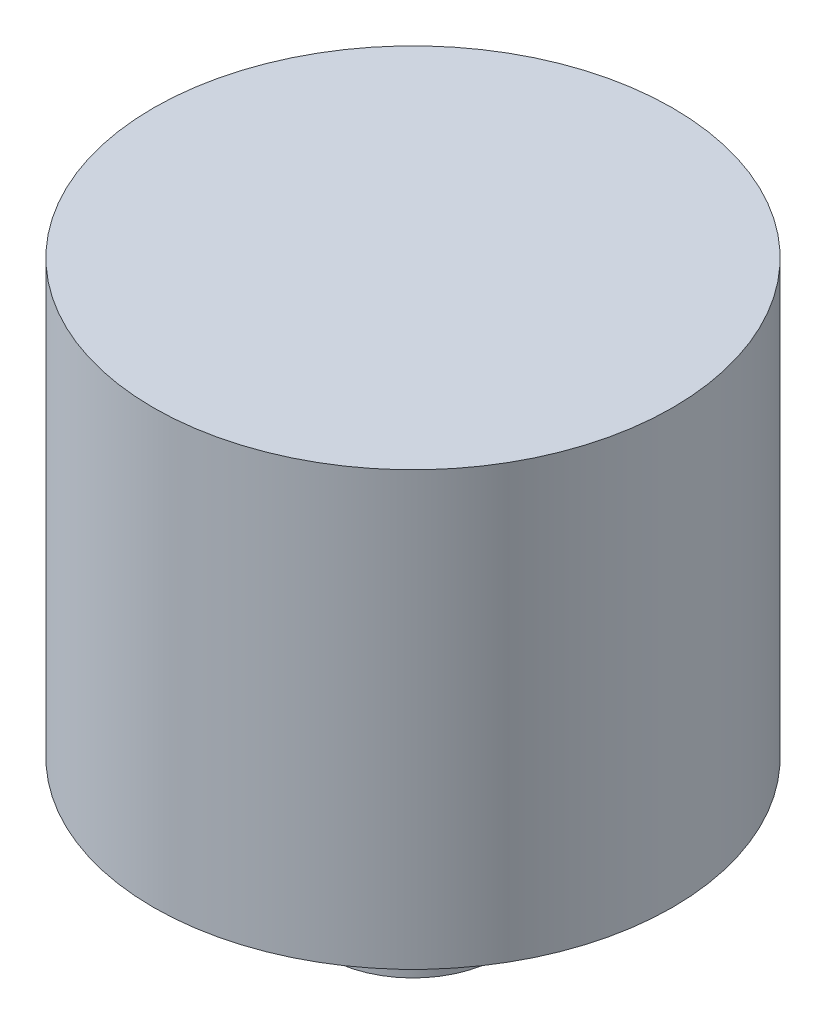
ISO-10303-21;
HEADER;
FILE_DESCRIPTION(('STEP AP214'),'2;1');
FILE_NAME('part.step','',(''),(''),'','','');
FILE_SCHEMA(('AUTOMOTIVE_DESIGN { 1 0 10303 214 1 1 1 1 }'));
ENDSEC;
DATA;
#1=APPLICATION_CONTEXT('core data for automotive mechanical design processes');
#2=APPLICATION_PROTOCOL_DEFINITION('international standard','automotive_design',2000,#1);
#3=PRODUCT_CONTEXT('',#1,'mechanical');
#4=PRODUCT('Part','Part','',(#3));
#5=PRODUCT_RELATED_PRODUCT_CATEGORY('part','',(#4));
#6=PRODUCT_DEFINITION_FORMATION('','',#4);
#7=PRODUCT_DEFINITION_CONTEXT('part definition',#1,'design');
#8=PRODUCT_DEFINITION('design','',#6,#7);
#9=PRODUCT_DEFINITION_SHAPE('','',#8);
#10=(LENGTH_UNIT() NAMED_UNIT(*) SI_UNIT(.MILLI.,.METRE.));
#11=(NAMED_UNIT(*) PLANE_ANGLE_UNIT() SI_UNIT($,.RADIAN.));
#12=(NAMED_UNIT(*) SI_UNIT($,.STERADIAN.) SOLID_ANGLE_UNIT());
#13=UNCERTAINTY_MEASURE_WITH_UNIT(LENGTH_MEASURE(1.E-05),#10,'distance_accuracy_value','');
#14=(GEOMETRIC_REPRESENTATION_CONTEXT(3) GLOBAL_UNCERTAINTY_ASSIGNED_CONTEXT((#13)) GLOBAL_UNIT_ASSIGNED_CONTEXT((#10,
#11,#12)) REPRESENTATION_CONTEXT('',''));
#15=CARTESIAN_POINT('',(0.,0.,0.));
#16=DIRECTION('',(0.,0.,1.));
#17=DIRECTION('',(1.,0.,0.));
#18=AXIS2_PLACEMENT_3D('',#15,#16,#17);
#19=CARTESIAN_POINT('',(0.,0.,0.));
#20=DIRECTION('',(0.,-1.,0.));
#21=DIRECTION('',(1.,0.,0.));
#22=AXIS2_PLACEMENT_3D('',#19,#20,#21);
#23=PLANE('',#22);
#24=CARTESIAN_POINT('',(0.,0.,0.));
#25=DIRECTION('',(0.,1.,0.));
#26=DIRECTION('',(-1.,0.,0.));
#27=AXIS2_PLACEMENT_3D('',#24,#25,#26);
#28=CIRCLE('',#27,2.);
#29=CARTESIAN_POINT('',(-2.,0.,0.));
#30=VERTEX_POINT('',#29);
#31=EDGE_CURVE('E10',#30,#30,#28,.T.);
#32=ORIENTED_EDGE('',*,*,#31,.F.);
#33=EDGE_LOOP('',(#32));
#34=FACE_BOUND('',#33,.T.);
#35=ADVANCED_FACE('F37',(#34),#23,.T.);
#36=CARTESIAN_POINT('',(0.,13.,0.));
#37=DIRECTION('',(0.,1.,0.));
#38=DIRECTION('',(-1.,0.,0.));
#39=AXIS2_PLACEMENT_3D('',#36,#37,#38);
#40=CYLINDRICAL_SURFACE('',#39,2.);
#41=ORIENTED_EDGE('',*,*,#31,.T.);
#42=EDGE_LOOP('',(#41));
#43=FACE_BOUND('',#42,.T.);
#44=CARTESIAN_POINT('',(0.,3.,0.));
#45=DIRECTION('',(0.,1.,0.));
#46=DIRECTION('',(-1.,0.,0.));
#47=AXIS2_PLACEMENT_3D('',#44,#45,#46);
#48=CIRCLE('',#47,2.);
#49=CARTESIAN_POINT('',(-2.,3.,0.));
#50=VERTEX_POINT('',#49);
#51=EDGE_CURVE('E43',#50,#50,#48,.T.);
#52=ORIENTED_EDGE('',*,*,#51,.F.);
#53=EDGE_LOOP('',(#52));
#54=FACE_BOUND('',#53,.T.);
#55=ADVANCED_FACE('F69',(#43,#54),#40,.T.);
#56=CARTESIAN_POINT('',(-2.,3.,0.));
#57=DIRECTION('',(0.,-1.,0.));
#58=DIRECTION('',(1.,0.,0.));
#59=AXIS2_PLACEMENT_3D('',#56,#57,#58);
#60=PLANE('',#59);
#61=ORIENTED_EDGE('',*,*,#51,.T.);
#62=EDGE_LOOP('',(#61));
#63=FACE_BOUND('',#62,.T.);
#64=CARTESIAN_POINT('',(0.,3.,0.));
#65=DIRECTION('',(0.,1.,0.));
#66=DIRECTION('',(-1.,0.,0.));
#67=AXIS2_PLACEMENT_3D('',#64,#65,#66);
#68=CIRCLE('',#67,6.);
#69=CARTESIAN_POINT('',(-6.,3.,0.));
#70=VERTEX_POINT('',#69);
#71=EDGE_CURVE('E47',#70,#70,#68,.T.);
#72=ORIENTED_EDGE('',*,*,#71,.F.);
#73=EDGE_LOOP('',(#72));
#74=FACE_BOUND('',#73,.T.);
#75=ADVANCED_FACE('F61',(#63,#74),#60,.T.);
#76=CARTESIAN_POINT('',(0.,13.,0.));
#77=DIRECTION('',(0.,1.,0.));
#78=DIRECTION('',(-1.,0.,0.));
#79=AXIS2_PLACEMENT_3D('',#76,#77,#78);
#80=CYLINDRICAL_SURFACE('',#79,6.);
#81=ORIENTED_EDGE('',*,*,#71,.T.);
#82=EDGE_LOOP('',(#81));
#83=FACE_BOUND('',#82,.T.);
#84=CARTESIAN_POINT('',(0.,13.,0.));
#85=DIRECTION('',(0.,1.,0.));
#86=DIRECTION('',(-1.,0.,0.));
#87=AXIS2_PLACEMENT_3D('',#84,#85,#86);
#88=CIRCLE('',#87,6.);
#89=CARTESIAN_POINT('',(-6.,13.,0.));
#90=VERTEX_POINT('',#89);
#91=EDGE_CURVE('E51',#90,#90,#88,.T.);
#92=ORIENTED_EDGE('',*,*,#91,.F.);
#93=EDGE_LOOP('',(#92));
#94=FACE_BOUND('',#93,.T.);
#95=ADVANCED_FACE('F59',(#83,#94),#80,.T.);
#96=CARTESIAN_POINT('',(-6.,13.,0.));
#97=DIRECTION('',(0.,1.,0.));
#98=DIRECTION('',(-1.,0.,0.));
#99=AXIS2_PLACEMENT_3D('',#96,#97,#98);
#100=PLANE('',#99);
#101=ORIENTED_EDGE('',*,*,#91,.T.);
#102=EDGE_LOOP('',(#101));
#103=FACE_BOUND('',#102,.T.);
#104=ADVANCED_FACE('F57',(#103),#100,.T.);
#105=CLOSED_SHELL('',(#35,#55,#75,#95,#104));
#106=MANIFOLD_SOLID_BREP('B2',#105);
#107=ADVANCED_BREP_SHAPE_REPRESENTATION('',(#18,#106),#14);
#108=SHAPE_DEFINITION_REPRESENTATION(#9,#107);
ENDSEC;
END-ISO-10303-21;
